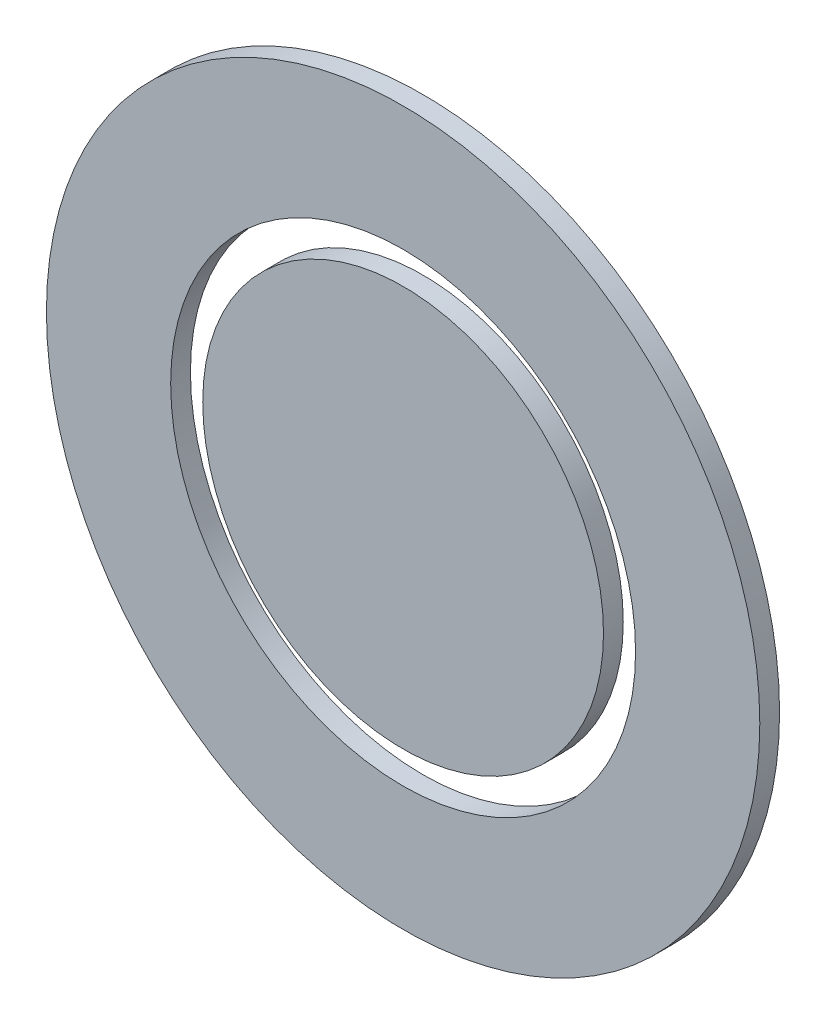
ISO-10303-21;
HEADER;
FILE_DESCRIPTION(('STEP AP214'),'2;1');
FILE_NAME('part.step','',(''),(''),'','','');
FILE_SCHEMA(('AUTOMOTIVE_DESIGN { 1 0 10303 214 1 1 1 1 }'));
ENDSEC;
DATA;
#1=APPLICATION_CONTEXT('core data for automotive mechanical design processes');
#2=APPLICATION_PROTOCOL_DEFINITION('international standard','automotive_design',2000,#1);
#3=PRODUCT_CONTEXT('',#1,'mechanical');
#4=PRODUCT('Part','Part','',(#3));
#5=PRODUCT_RELATED_PRODUCT_CATEGORY('part','',(#4));
#6=PRODUCT_DEFINITION_FORMATION('','',#4);
#7=PRODUCT_DEFINITION_CONTEXT('part definition',#1,'design');
#8=PRODUCT_DEFINITION('design','',#6,#7);
#9=PRODUCT_DEFINITION_SHAPE('','',#8);
#10=(LENGTH_UNIT() NAMED_UNIT(*) SI_UNIT(.MILLI.,.METRE.));
#11=(NAMED_UNIT(*) PLANE_ANGLE_UNIT() SI_UNIT($,.RADIAN.));
#12=(NAMED_UNIT(*) SI_UNIT($,.STERADIAN.) SOLID_ANGLE_UNIT());
#13=UNCERTAINTY_MEASURE_WITH_UNIT(LENGTH_MEASURE(1.E-05),#10,'distance_accuracy_value','');
#14=(GEOMETRIC_REPRESENTATION_CONTEXT(3) GLOBAL_UNCERTAINTY_ASSIGNED_CONTEXT((#13)) GLOBAL_UNIT_ASSIGNED_CONTEXT((#10,
#11,#12)) REPRESENTATION_CONTEXT('',''));
#15=CARTESIAN_POINT('',(0.,0.,0.));
#16=DIRECTION('',(0.,0.,1.));
#17=DIRECTION('',(1.,0.,0.));
#18=AXIS2_PLACEMENT_3D('',#15,#16,#17);
#19=CARTESIAN_POINT('',(0.,0.,7.4));
#20=DIRECTION('',(0.,0.,1.));
#21=DIRECTION('',(1.,0.,0.));
#22=AXIS2_PLACEMENT_3D('',#19,#20,#21);
#23=PLANE('',#22);
#24=CARTESIAN_POINT('',(0.,0.,7.4));
#25=DIRECTION('',(0.,0.,1.));
#26=DIRECTION('',(1.,0.,0.));
#27=AXIS2_PLACEMENT_3D('',#24,#25,#26);
#28=CIRCLE('',#27,133.5);
#29=CARTESIAN_POINT('',(133.5,0.,7.4));
#30=VERTEX_POINT('',#29);
#31=EDGE_CURVE('E12',#30,#30,#28,.T.);
#32=ORIENTED_EDGE('',*,*,#31,.T.);
#33=EDGE_LOOP('',(#32));
#34=FACE_BOUND('',#33,.T.);
#35=CARTESIAN_POINT('',(0.,0.,7.4));
#36=DIRECTION('',(0.,0.,1.));
#37=DIRECTION('',(1.,0.,0.));
#38=AXIS2_PLACEMENT_3D('',#35,#36,#37);
#39=CIRCLE('',#38,87.);
#40=CARTESIAN_POINT('',(87.,0.,7.4));
#41=VERTEX_POINT('',#40);
#42=EDGE_CURVE('E57',#41,#41,#39,.T.);
#43=ORIENTED_EDGE('',*,*,#42,.F.);
#44=EDGE_LOOP('',(#43));
#45=FACE_BOUND('',#44,.T.);
#46=ADVANCED_FACE('F46',(#34,#45),#23,.T.);
#47=CARTESIAN_POINT('',(0.,0.,0.));
#48=DIRECTION('',(0.,0.,1.));
#49=DIRECTION('',(1.,0.,0.));
#50=AXIS2_PLACEMENT_3D('',#47,#48,#49);
#51=PLANE('',#50);
#52=CARTESIAN_POINT('',(0.,0.,0.));
#53=DIRECTION('',(0.,0.,1.));
#54=DIRECTION('',(1.,0.,0.));
#55=AXIS2_PLACEMENT_3D('',#52,#53,#54);
#56=CIRCLE('',#55,133.5);
#57=CARTESIAN_POINT('',(133.5,0.,0.));
#58=VERTEX_POINT('',#57);
#59=EDGE_CURVE('E50',#58,#58,#56,.T.);
#60=ORIENTED_EDGE('',*,*,#59,.F.);
#61=EDGE_LOOP('',(#60));
#62=FACE_BOUND('',#61,.T.);
#63=CARTESIAN_POINT('',(0.,0.,0.));
#64=DIRECTION('',(0.,0.,1.));
#65=DIRECTION('',(1.,0.,0.));
#66=AXIS2_PLACEMENT_3D('',#63,#64,#65);
#67=CIRCLE('',#66,87.);
#68=CARTESIAN_POINT('',(87.,0.,0.));
#69=VERTEX_POINT('',#68);
#70=EDGE_CURVE('E59',#69,#69,#67,.T.);
#71=ORIENTED_EDGE('',*,*,#70,.T.);
#72=EDGE_LOOP('',(#71));
#73=FACE_BOUND('',#72,.T.);
#74=ADVANCED_FACE('F69',(#62,#73),#51,.F.);
#75=CARTESIAN_POINT('',(0.,0.,7.4));
#76=DIRECTION('',(0.,0.,-1.));
#77=DIRECTION('',(-1.,0.,0.));
#78=AXIS2_PLACEMENT_3D('',#75,#76,#77);
#79=CYLINDRICAL_SURFACE('',#78,133.5);
#80=ORIENTED_EDGE('',*,*,#31,.F.);
#81=EDGE_LOOP('',(#80));
#82=FACE_BOUND('',#81,.T.);
#83=ORIENTED_EDGE('',*,*,#59,.T.);
#84=EDGE_LOOP('',(#83));
#85=FACE_BOUND('',#84,.T.);
#86=ADVANCED_FACE('F48',(#82,#85),#79,.T.);
#87=CARTESIAN_POINT('',(0.,0.,7.4));
#88=DIRECTION('',(0.,0.,-1.));
#89=DIRECTION('',(-1.,0.,0.));
#90=AXIS2_PLACEMENT_3D('',#87,#88,#89);
#91=CYLINDRICAL_SURFACE('',#90,87.);
#92=ORIENTED_EDGE('',*,*,#42,.T.);
#93=EDGE_LOOP('',(#92));
#94=FACE_BOUND('',#93,.T.);
#95=ORIENTED_EDGE('',*,*,#70,.F.);
#96=EDGE_LOOP('',(#95));
#97=FACE_BOUND('',#96,.T.);
#98=ADVANCED_FACE('F65',(#94,#97),#91,.F.);
#99=CLOSED_SHELL('',(#46,#74,#86,#98));
#100=MANIFOLD_SOLID_BREP('B2',#99);
#101=CARTESIAN_POINT('',(0.,0.,7.4));
#102=DIRECTION('',(0.,0.,-1.));
#103=DIRECTION('',(-1.,0.,0.));
#104=AXIS2_PLACEMENT_3D('',#101,#102,#103);
#105=CYLINDRICAL_SURFACE('',#104,75.);
#106=CARTESIAN_POINT('',(0.,0.,7.4));
#107=DIRECTION('',(0.,0.,1.));
#108=DIRECTION('',(1.,0.,0.));
#109=AXIS2_PLACEMENT_3D('',#106,#107,#108);
#110=CIRCLE('',#109,75.);
#111=CARTESIAN_POINT('',(75.,0.,7.4));
#112=VERTEX_POINT('',#111);
#113=EDGE_CURVE('E45',#112,#112,#110,.T.);
#114=ORIENTED_EDGE('',*,*,#113,.F.);
#115=EDGE_LOOP('',(#114));
#116=FACE_BOUND('',#115,.T.);
#117=CARTESIAN_POINT('',(0.,0.,0.));
#118=DIRECTION('',(0.,0.,1.));
#119=DIRECTION('',(1.,0.,0.));
#120=AXIS2_PLACEMENT_3D('',#117,#118,#119);
#121=CIRCLE('',#120,75.);
#122=CARTESIAN_POINT('',(75.,0.,0.));
#123=VERTEX_POINT('',#122);
#124=EDGE_CURVE('E110',#123,#123,#121,.T.);
#125=ORIENTED_EDGE('',*,*,#124,.T.);
#126=EDGE_LOOP('',(#125));
#127=FACE_BOUND('',#126,.T.);
#128=ADVANCED_FACE('F107',(#116,#127),#105,.T.);
#129=CARTESIAN_POINT('',(0.,0.,7.4));
#130=DIRECTION('',(0.,0.,1.));
#131=DIRECTION('',(1.,0.,0.));
#132=AXIS2_PLACEMENT_3D('',#129,#130,#131);
#133=PLANE('',#132);
#134=ORIENTED_EDGE('',*,*,#113,.T.);
#135=EDGE_LOOP('',(#134));
#136=FACE_BOUND('',#135,.T.);
#137=ADVANCED_FACE('F122',(#136),#133,.T.);
#138=CARTESIAN_POINT('',(0.,0.,0.));
#139=DIRECTION('',(0.,0.,1.));
#140=DIRECTION('',(1.,0.,0.));
#141=AXIS2_PLACEMENT_3D('',#138,#139,#140);
#142=PLANE('',#141);
#143=ORIENTED_EDGE('',*,*,#124,.F.);
#144=EDGE_LOOP('',(#143));
#145=FACE_BOUND('',#144,.T.);
#146=ADVANCED_FACE('F120',(#145),#142,.F.);
#147=CLOSED_SHELL('',(#128,#137,#146));
#148=MANIFOLD_SOLID_BREP('B7',#147);
#149=ADVANCED_BREP_SHAPE_REPRESENTATION('',(#18,#100,#148),#14);
#150=SHAPE_DEFINITION_REPRESENTATION(#9,#149);
ENDSEC;
END-ISO-10303-21;
